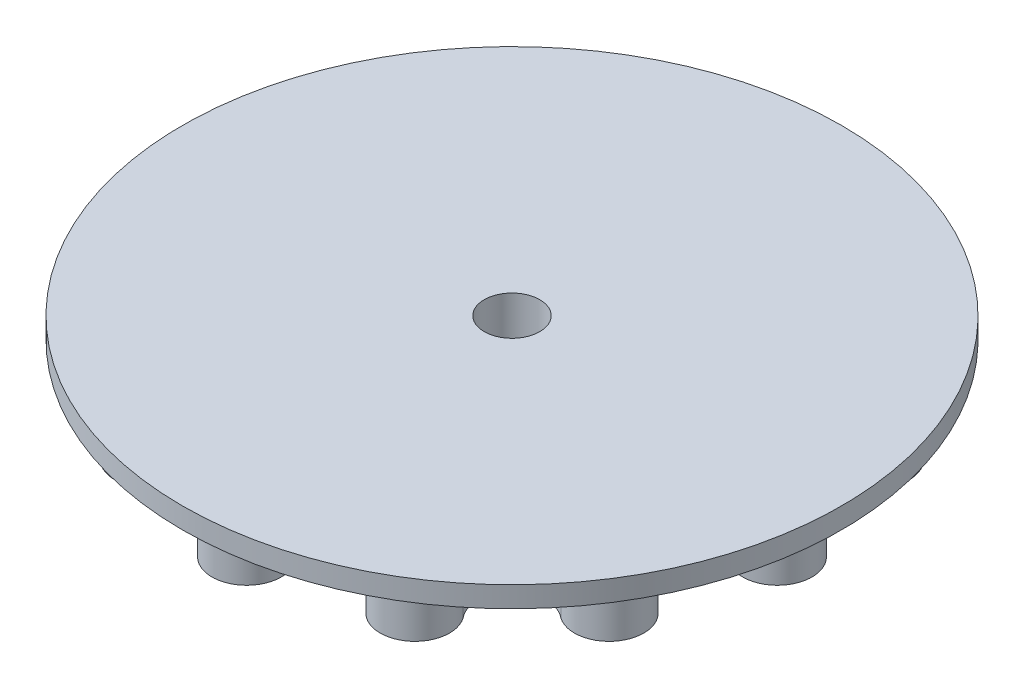
ISO-10303-21;
HEADER;
FILE_DESCRIPTION(('STEP AP214'),'2;1');
FILE_NAME('part.step','',(''),(''),'','','');
FILE_SCHEMA(('AUTOMOTIVE_DESIGN { 1 0 10303 214 1 1 1 1 }'));
ENDSEC;
DATA;
#1=APPLICATION_CONTEXT('core data for automotive mechanical design processes');
#2=APPLICATION_PROTOCOL_DEFINITION('international standard','automotive_design',2000,#1);
#3=PRODUCT_CONTEXT('',#1,'mechanical');
#4=PRODUCT('Part','Part','',(#3));
#5=PRODUCT_RELATED_PRODUCT_CATEGORY('part','',(#4));
#6=PRODUCT_DEFINITION_FORMATION('','',#4);
#7=PRODUCT_DEFINITION_CONTEXT('part definition',#1,'design');
#8=PRODUCT_DEFINITION('design','',#6,#7);
#9=PRODUCT_DEFINITION_SHAPE('','',#8);
#10=(LENGTH_UNIT() NAMED_UNIT(*) SI_UNIT(.MILLI.,.METRE.));
#11=(NAMED_UNIT(*) PLANE_ANGLE_UNIT() SI_UNIT($,.RADIAN.));
#12=(NAMED_UNIT(*) SI_UNIT($,.STERADIAN.) SOLID_ANGLE_UNIT());
#13=UNCERTAINTY_MEASURE_WITH_UNIT(LENGTH_MEASURE(1.E-05),#10,'distance_accuracy_value','');
#14=(GEOMETRIC_REPRESENTATION_CONTEXT(3) GLOBAL_UNCERTAINTY_ASSIGNED_CONTEXT((#13)) GLOBAL_UNIT_ASSIGNED_CONTEXT((#10,
#11,#12)) REPRESENTATION_CONTEXT('',''));
#15=CARTESIAN_POINT('',(0.,0.,0.));
#16=DIRECTION('',(0.,0.,1.));
#17=DIRECTION('',(1.,0.,0.));
#18=AXIS2_PLACEMENT_3D('',#15,#16,#17);
#19=CARTESIAN_POINT('',(-9.89982847517093,8.,-36.946662855557));
#20=DIRECTION('',(0.,-1.,0.));
#21=DIRECTION('',(0.,0.,-1.));
#22=AXIS2_PLACEMENT_3D('',#19,#20,#21);
#23=CYLINDRICAL_SURFACE('',#22,5.00000000000001);
#24=CARTESIAN_POINT('',(-9.89982847517093,0.,-36.946662855557));
#25=DIRECTION('',(0.,1.,0.));
#26=DIRECTION('',(0.,0.,1.));
#27=AXIS2_PLACEMENT_3D('',#24,#25,#26);
#28=CIRCLE('',#27,5.00000000000001);
#29=CARTESIAN_POINT('',(-14.6162880231152,0.,-35.2868407769579));
#30=VERTEX_POINT('',#29);
#31=CARTESIAN_POINT('',(-4.98534365143035,0.,-37.8674445437022));
#32=VERTEX_POINT('',#31);
#33=EDGE_CURVE('E242',#30,#32,#28,.T.);
#34=ORIENTED_EDGE('',*,*,#33,.F.);
#35=DIRECTION('',(0.,-1.,0.));
#36=VECTOR('',#35,1.);
#37=CARTESIAN_POINT('',(-14.6162880231152,8.,-35.2868407769579));
#38=LINE('',#37,#36);
#39=CARTESIAN_POINT('',(-14.6162880231152,8.,-35.2868407769579));
#40=VERTEX_POINT('',#39);
#41=EDGE_CURVE('E11',#40,#30,#38,.T.);
#42=ORIENTED_EDGE('',*,*,#41,.F.);
#43=CARTESIAN_POINT('',(-9.89982847517093,8.,-36.946662855557));
#44=DIRECTION('',(0.,1.,0.));
#45=DIRECTION('',(0.,0.,1.));
#46=AXIS2_PLACEMENT_3D('',#43,#44,#45);
#47=CIRCLE('',#46,5.00000000000001);
#48=CARTESIAN_POINT('',(-4.98534365143035,8.,-37.8674445437022));
#49=VERTEX_POINT('',#48);
#50=EDGE_CURVE('E311',#40,#49,#47,.T.);
#51=ORIENTED_EDGE('',*,*,#50,.T.);
#52=DIRECTION('',(0.,-1.,0.));
#53=VECTOR('',#52,1.);
#54=CARTESIAN_POINT('',(-4.98534365143035,8.,-37.8674445437022));
#55=LINE('',#54,#53);
#56=EDGE_CURVE('E141',#49,#32,#55,.T.);
#57=ORIENTED_EDGE('',*,*,#56,.T.);
#58=EDGE_LOOP('',(#34,#42,#51,#57));
#59=FACE_BOUND('',#58,.T.);
#60=ADVANCED_FACE('F43',(#59),#23,.F.);
#61=CARTESIAN_POINT('',(-19.1249999999998,8.,-33.125471694754));
#62=DIRECTION('',(0.,-1.,0.));
#63=DIRECTION('',(0.,0.,-1.));
#64=AXIS2_PLACEMENT_3D('',#61,#62,#63);
#65=CYLINDRICAL_SURFACE('',#64,5.00000000000093);
#66=CARTESIAN_POINT('',(-19.1249999999998,0.,-33.125471694754));
#67=DIRECTION('',(0.,1.,0.));
#68=DIRECTION('',(0.,0.,1.));
#69=AXIS2_PLACEMENT_3D('',#66,#67,#68);
#70=CIRCLE('',#69,5.00000000000093);
#71=CARTESIAN_POINT('',(-23.2511565205944,0.,-30.3014971255406));
#72=VERTEX_POINT('',#71);
#73=EDGE_CURVE('E245',#30,#72,#70,.T.);
#74=ORIENTED_EDGE('',*,*,#73,.T.);
#75=DIRECTION('',(0.,-1.,0.));
#76=VECTOR('',#75,1.);
#77=CARTESIAN_POINT('',(-23.2511565205944,8.,-30.3014971255406));
#78=LINE('',#77,#76);
#79=CARTESIAN_POINT('',(-23.2511565205944,8.,-30.3014971255406));
#80=VERTEX_POINT('',#79);
#81=EDGE_CURVE('E51',#80,#72,#78,.T.);
#82=ORIENTED_EDGE('',*,*,#81,.F.);
#83=CARTESIAN_POINT('',(-19.1249999999998,8.,-33.125471694754));
#84=DIRECTION('',(0.,1.,0.));
#85=DIRECTION('',(0.,0.,1.));
#86=AXIS2_PLACEMENT_3D('',#83,#84,#85);
#87=CIRCLE('',#86,5.00000000000093);
#88=EDGE_CURVE('E373',#40,#80,#87,.T.);
#89=ORIENTED_EDGE('',*,*,#88,.F.);
#90=ORIENTED_EDGE('',*,*,#41,.T.);
#91=EDGE_LOOP('',(#74,#82,#89,#90));
#92=FACE_BOUND('',#91,.T.);
#93=ADVANCED_FACE('F358',(#92),#65,.T.);
#94=CARTESIAN_POINT('',(-27.046834380385,8.,-27.0468343803843));
#95=DIRECTION('',(0.,-1.,0.));
#96=DIRECTION('',(0.,0.,-1.));
#97=AXIS2_PLACEMENT_3D('',#94,#95,#96);
#98=CYLINDRICAL_SURFACE('',#97,5.00000000000125);
#99=CARTESIAN_POINT('',(-27.046834380385,0.,-27.0468343803843));
#100=DIRECTION('',(0.,1.,0.));
#101=DIRECTION('',(0.,0.,1.));
#102=AXIS2_PLACEMENT_3D('',#99,#100,#101);
#103=CIRCLE('',#102,5.00000000000125);
#104=CARTESIAN_POINT('',(-30.3014971255457,0.,-23.2511565205975));
#105=VERTEX_POINT('',#104);
#106=EDGE_CURVE('E249',#105,#72,#103,.T.);
#107=ORIENTED_EDGE('',*,*,#106,.F.);
#108=DIRECTION('',(0.,-1.,0.));
#109=VECTOR('',#108,1.);
#110=CARTESIAN_POINT('',(-30.3014971255457,8.,-23.2511565205975));
#111=LINE('',#110,#109);
#112=CARTESIAN_POINT('',(-30.3014971255457,8.,-23.2511565205975));
#113=VERTEX_POINT('',#112);
#114=EDGE_CURVE('E348',#113,#105,#111,.T.);
#115=ORIENTED_EDGE('',*,*,#114,.F.);
#116=CARTESIAN_POINT('',(-27.046834380385,8.,-27.0468343803843));
#117=DIRECTION('',(0.,1.,0.));
#118=DIRECTION('',(0.,0.,1.));
#119=AXIS2_PLACEMENT_3D('',#116,#117,#118);
#120=CIRCLE('',#119,5.00000000000125);
#121=EDGE_CURVE('E354',#113,#80,#120,.T.);
#122=ORIENTED_EDGE('',*,*,#121,.T.);
#123=ORIENTED_EDGE('',*,*,#81,.T.);
#124=EDGE_LOOP('',(#107,#115,#122,#123));
#125=FACE_BOUND('',#124,.T.);
#126=ADVANCED_FACE('F352',(#125),#98,.F.);
#127=CARTESIAN_POINT('',(-33.125471694754,8.,-19.1249999999986));
#128=DIRECTION('',(0.,-1.,0.));
#129=DIRECTION('',(0.,0.,-1.));
#130=AXIS2_PLACEMENT_3D('',#127,#128,#129);
#131=CYLINDRICAL_SURFACE('',#130,5.00000000000165);
#132=CARTESIAN_POINT('',(-33.125471694754,0.,-19.1249999999986));
#133=DIRECTION('',(0.,1.,0.));
#134=DIRECTION('',(0.,0.,1.));
#135=AXIS2_PLACEMENT_3D('',#132,#133,#134);
#136=CIRCLE('',#135,5.00000000000165);
#137=CARTESIAN_POINT('',(-35.2868407769857,0.,-14.6162880231265));
#138=VERTEX_POINT('',#137);
#139=EDGE_CURVE('E252',#105,#138,#136,.T.);
#140=ORIENTED_EDGE('',*,*,#139,.T.);
#141=DIRECTION('',(0.,-1.,0.));
#142=VECTOR('',#141,1.);
#143=CARTESIAN_POINT('',(-35.2868407769857,8.,-14.6162880231265));
#144=LINE('',#143,#142);
#145=CARTESIAN_POINT('',(-35.2868407769857,8.,-14.6162880231265));
#146=VERTEX_POINT('',#145);
#147=EDGE_CURVE('E346',#146,#138,#144,.T.);
#148=ORIENTED_EDGE('',*,*,#147,.F.);
#149=CARTESIAN_POINT('',(-33.125471694754,8.,-19.1249999999986));
#150=DIRECTION('',(0.,1.,0.));
#151=DIRECTION('',(0.,0.,1.));
#152=AXIS2_PLACEMENT_3D('',#149,#150,#151);
#153=CIRCLE('',#152,5.00000000000165);
#154=EDGE_CURVE('E369',#113,#146,#153,.T.);
#155=ORIENTED_EDGE('',*,*,#154,.F.);
#156=ORIENTED_EDGE('',*,*,#114,.T.);
#157=EDGE_LOOP('',(#140,#148,#155,#156));
#158=FACE_BOUND('',#157,.T.);
#159=ADVANCED_FACE('F365',(#158),#131,.T.);
#160=CARTESIAN_POINT('',(-36.9466628555557,8.,-9.89982847516984));
#161=DIRECTION('',(0.,-1.,0.));
#162=DIRECTION('',(0.,0.,-1.));
#163=AXIS2_PLACEMENT_3D('',#160,#161,#162);
#164=CYLINDRICAL_SURFACE('',#163,5.00000000000203);
#165=CARTESIAN_POINT('',(-36.9466628555557,0.,-9.89982847516984));
#166=DIRECTION('',(0.,1.,0.));
#167=DIRECTION('',(0.,0.,1.));
#168=AXIS2_PLACEMENT_3D('',#165,#166,#167);
#169=CIRCLE('',#168,5.00000000000203);
#170=CARTESIAN_POINT('',(-37.8674445437367,0.,-4.98534365143392));
#171=VERTEX_POINT('',#170);
#172=EDGE_CURVE('E255',#171,#138,#169,.T.);
#173=ORIENTED_EDGE('',*,*,#172,.F.);
#174=DIRECTION('',(0.,-1.,0.));
#175=VECTOR('',#174,1.);
#176=CARTESIAN_POINT('',(-37.8674445437367,8.,-4.98534365143392));
#177=LINE('',#176,#175);
#178=CARTESIAN_POINT('',(-37.8674445437367,8.,-4.98534365143392));
#179=VERTEX_POINT('',#178);
#180=EDGE_CURVE('E344',#179,#171,#177,.T.);
#181=ORIENTED_EDGE('',*,*,#180,.F.);
#182=CARTESIAN_POINT('',(-36.9466628555557,8.,-9.89982847516984));
#183=DIRECTION('',(0.,1.,0.));
#184=DIRECTION('',(0.,0.,1.));
#185=AXIS2_PLACEMENT_3D('',#182,#183,#184);
#186=CIRCLE('',#185,5.00000000000203);
#187=EDGE_CURVE('E371',#179,#146,#186,.T.);
#188=ORIENTED_EDGE('',*,*,#187,.T.);
#189=ORIENTED_EDGE('',*,*,#147,.T.);
#190=EDGE_LOOP('',(#173,#181,#188,#189));
#191=FACE_BOUND('',#190,.T.);
#192=ADVANCED_FACE('F679',(#191),#164,.F.);
#193=CARTESIAN_POINT('',(-38.2499999999984,8.,1.62835344156606E-12));
#194=DIRECTION('',(0.,-1.,0.));
#195=DIRECTION('',(0.,0.,-1.));
#196=AXIS2_PLACEMENT_3D('',#193,#194,#195);
#197=CYLINDRICAL_SURFACE('',#196,5.00000000000242);
#198=CARTESIAN_POINT('',(-38.2499999999984,0.,1.62835344156606E-12));
#199=DIRECTION('',(0.,1.,0.));
#200=DIRECTION('',(0.,0.,1.));
#201=AXIS2_PLACEMENT_3D('',#198,#199,#200);
#202=CIRCLE('',#201,5.00000000000242);
#203=CARTESIAN_POINT('',(-37.8674445437431,0.,4.98534365143767));
#204=VERTEX_POINT('',#203);
#205=EDGE_CURVE('E258',#171,#204,#202,.T.);
#206=ORIENTED_EDGE('',*,*,#205,.T.);
#207=DIRECTION('',(0.,-1.,0.));
#208=VECTOR('',#207,1.);
#209=CARTESIAN_POINT('',(-37.8674445437431,8.,4.98534365143767));
#210=LINE('',#209,#208);
#211=CARTESIAN_POINT('',(-37.8674445437431,8.,4.98534365143767));
#212=VERTEX_POINT('',#211);
#213=EDGE_CURVE('E342',#212,#204,#210,.T.);
#214=ORIENTED_EDGE('',*,*,#213,.F.);
#215=CARTESIAN_POINT('',(-38.2499999999984,8.,1.62835344156606E-12));
#216=DIRECTION('',(0.,1.,0.));
#217=DIRECTION('',(0.,0.,1.));
#218=AXIS2_PLACEMENT_3D('',#215,#216,#217);
#219=CIRCLE('',#218,5.00000000000242);
#220=EDGE_CURVE('E379',#179,#212,#219,.T.);
#221=ORIENTED_EDGE('',*,*,#220,.F.);
#222=ORIENTED_EDGE('',*,*,#180,.T.);
#223=EDGE_LOOP('',(#206,#214,#221,#222));
#224=FACE_BOUND('',#223,.T.);
#225=ADVANCED_FACE('F669',(#224),#197,.T.);
#226=CARTESIAN_POINT('',(-36.9466628555548,8.,9.89982847517302));
#227=DIRECTION('',(0.,-1.,0.));
#228=DIRECTION('',(0.,0.,-1.));
#229=AXIS2_PLACEMENT_3D('',#226,#227,#228);
#230=CYLINDRICAL_SURFACE('',#229,5.0000000000028);
#231=CARTESIAN_POINT('',(-36.9466628555548,0.,9.89982847517302));
#232=DIRECTION('',(0.,1.,0.));
#233=DIRECTION('',(0.,0.,1.));
#234=AXIS2_PLACEMENT_3D('',#231,#232,#233);
#235=CIRCLE('',#234,5.0000000000028);
#236=CARTESIAN_POINT('',(-35.2868407770035,0.,14.6162880231371));
#237=VERTEX_POINT('',#236);
#238=EDGE_CURVE('E261',#237,#204,#235,.T.);
#239=ORIENTED_EDGE('',*,*,#238,.F.);
#240=DIRECTION('',(0.,-1.,0.));
#241=VECTOR('',#240,1.);
#242=CARTESIAN_POINT('',(-35.2868407770035,8.,14.6162880231371));
#243=LINE('',#242,#241);
#244=CARTESIAN_POINT('',(-35.2868407770035,8.,14.6162880231371));
#245=VERTEX_POINT('',#244);
#246=EDGE_CURVE('E340',#245,#237,#243,.T.);
#247=ORIENTED_EDGE('',*,*,#246,.F.);
#248=CARTESIAN_POINT('',(-36.9466628555548,8.,9.89982847517302));
#249=DIRECTION('',(0.,1.,0.));
#250=DIRECTION('',(0.,0.,1.));
#251=AXIS2_PLACEMENT_3D('',#248,#249,#250);
#252=CIRCLE('',#251,5.0000000000028);
#253=EDGE_CURVE('E382',#245,#212,#252,.T.);
#254=ORIENTED_EDGE('',*,*,#253,.T.);
#255=ORIENTED_EDGE('',*,*,#213,.T.);
#256=EDGE_LOOP('',(#239,#247,#254,#255));
#257=FACE_BOUND('',#256,.T.);
#258=ADVANCED_FACE('F659',(#257),#230,.F.);
#259=CARTESIAN_POINT('',(-33.1254716947523,8.,19.1250000000014));
#260=DIRECTION('',(0.,-1.,0.));
#261=DIRECTION('',(0.,0.,-1.));
#262=AXIS2_PLACEMENT_3D('',#259,#260,#261);
#263=CYLINDRICAL_SURFACE('',#262,5.00000000000309);
#264=CARTESIAN_POINT('',(-33.1254716947523,0.,19.1250000000014));
#265=DIRECTION('',(0.,1.,0.));
#266=DIRECTION('',(0.,0.,1.));
#267=AXIS2_PLACEMENT_3D('',#264,#265,#266);
#268=CIRCLE('',#267,5.00000000000309);
#269=CARTESIAN_POINT('',(-30.3014971255698,0.,23.2511565206198));
#270=VERTEX_POINT('',#269);
#271=EDGE_CURVE('E264',#237,#270,#268,.T.);
#272=ORIENTED_EDGE('',*,*,#271,.T.);
#273=DIRECTION('',(0.,-1.,0.));
#274=VECTOR('',#273,1.);
#275=CARTESIAN_POINT('',(-30.3014971255698,8.,23.2511565206198));
#276=LINE('',#275,#274);
#277=CARTESIAN_POINT('',(-30.3014971255698,8.,23.2511565206198));
#278=VERTEX_POINT('',#277);
#279=EDGE_CURVE('E338',#278,#270,#276,.T.);
#280=ORIENTED_EDGE('',*,*,#279,.F.);
#281=CARTESIAN_POINT('',(-33.1254716947523,8.,19.1250000000014));
#282=DIRECTION('',(0.,1.,0.));
#283=DIRECTION('',(0.,0.,1.));
#284=AXIS2_PLACEMENT_3D('',#281,#282,#283);
#285=CIRCLE('',#284,5.00000000000309);
#286=EDGE_CURVE('E385',#245,#278,#285,.T.);
#287=ORIENTED_EDGE('',*,*,#286,.F.);
#288=ORIENTED_EDGE('',*,*,#246,.T.);
#289=EDGE_LOOP('',(#272,#280,#287,#288));
#290=FACE_BOUND('',#289,.T.);
#291=ADVANCED_FACE('F649',(#290),#263,.T.);
#292=CARTESIAN_POINT('',(-27.0468343803827,8.,27.0468343803866));
#293=DIRECTION('',(0.,-1.,0.));
#294=DIRECTION('',(0.,0.,-1.));
#295=AXIS2_PLACEMENT_3D('',#292,#293,#294);
#296=CYLINDRICAL_SURFACE('',#295,5.00000000000333);
#297=CARTESIAN_POINT('',(-27.0468343803827,0.,27.0468343803866));
#298=DIRECTION('',(0.,1.,0.));
#299=DIRECTION('',(0.,0.,1.));
#300=AXIS2_PLACEMENT_3D('',#297,#298,#299);
#301=CIRCLE('',#300,5.00000000000333);
#302=CARTESIAN_POINT('',(-23.2511565206177,0.,30.3014971255759));
#303=VERTEX_POINT('',#302);
#304=EDGE_CURVE('E267',#303,#270,#301,.T.);
#305=ORIENTED_EDGE('',*,*,#304,.F.);
#306=DIRECTION('',(0.,-1.,0.));
#307=VECTOR('',#306,1.);
#308=CARTESIAN_POINT('',(-23.2511565206177,8.,30.3014971255759));
#309=LINE('',#308,#307);
#310=CARTESIAN_POINT('',(-23.2511565206177,8.,30.3014971255759));
#311=VERTEX_POINT('',#310);
#312=EDGE_CURVE('E336',#311,#303,#309,.T.);
#313=ORIENTED_EDGE('',*,*,#312,.F.);
#314=CARTESIAN_POINT('',(-27.0468343803827,8.,27.0468343803866));
#315=DIRECTION('',(0.,1.,0.));
#316=DIRECTION('',(0.,0.,1.));
#317=AXIS2_PLACEMENT_3D('',#314,#315,#316);
#318=CIRCLE('',#317,5.00000000000333);
#319=EDGE_CURVE('E388',#311,#278,#318,.T.);
#320=ORIENTED_EDGE('',*,*,#319,.T.);
#321=ORIENTED_EDGE('',*,*,#279,.T.);
#322=EDGE_LOOP('',(#305,#313,#320,#321));
#323=FACE_BOUND('',#322,.T.);
#324=ADVANCED_FACE('F639',(#323),#296,.F.);
#325=CARTESIAN_POINT('',(-19.124999999997,8.,33.1254716947556));
#326=DIRECTION('',(0.,-1.,0.));
#327=DIRECTION('',(0.,0.,-1.));
#328=AXIS2_PLACEMENT_3D('',#325,#326,#327);
#329=CYLINDRICAL_SURFACE('',#328,5.00000000000344);
#330=CARTESIAN_POINT('',(-19.124999999997,0.,33.1254716947556));
#331=DIRECTION('',(0.,1.,0.));
#332=DIRECTION('',(0.,0.,1.));
#333=AXIS2_PLACEMENT_3D('',#330,#331,#332);
#334=CIRCLE('',#333,5.00000000000344);
#335=CARTESIAN_POINT('',(-14.6162880231361,0.,35.2868407770147));
#336=VERTEX_POINT('',#335);
#337=EDGE_CURVE('E270',#303,#336,#334,.T.);
#338=ORIENTED_EDGE('',*,*,#337,.T.);
#339=DIRECTION('',(0.,-1.,0.));
#340=VECTOR('',#339,1.);
#341=CARTESIAN_POINT('',(-14.6162880231361,8.,35.2868407770147));
#342=LINE('',#341,#340);
#343=CARTESIAN_POINT('',(-14.6162880231361,8.,35.2868407770147));
#344=VERTEX_POINT('',#343);
#345=EDGE_CURVE('E334',#344,#336,#342,.T.);
#346=ORIENTED_EDGE('',*,*,#345,.F.);
#347=CARTESIAN_POINT('',(-19.124999999997,8.,33.1254716947556));
#348=DIRECTION('',(0.,1.,0.));
#349=DIRECTION('',(0.,0.,1.));
#350=AXIS2_PLACEMENT_3D('',#347,#348,#349);
#351=CIRCLE('',#350,5.00000000000344);
#352=EDGE_CURVE('E391',#311,#344,#351,.T.);
#353=ORIENTED_EDGE('',*,*,#352,.F.);
#354=ORIENTED_EDGE('',*,*,#312,.T.);
#355=EDGE_LOOP('',(#338,#346,#353,#354));
#356=FACE_BOUND('',#355,.T.);
#357=ADVANCED_FACE('F629',(#356),#329,.T.);
#358=CARTESIAN_POINT('',(-9.89982847516822,8.,36.9466628555573));
#359=DIRECTION('',(0.,-1.,0.));
#360=DIRECTION('',(0.,0.,-1.));
#361=AXIS2_PLACEMENT_3D('',#358,#359,#360);
#362=CYLINDRICAL_SURFACE('',#361,5.00000000000346);
#363=CARTESIAN_POINT('',(-9.89982847516822,0.,36.9466628555573));
#364=DIRECTION('',(0.,1.,0.));
#365=DIRECTION('',(0.,0.,1.));
#366=AXIS2_PLACEMENT_3D('',#363,#364,#365);
#367=CIRCLE('',#366,5.00000000000346);
#368=CARTESIAN_POINT('',(-4.98534365143491,0.,37.8674445437601));
#369=VERTEX_POINT('',#368);
#370=EDGE_CURVE('E273',#369,#336,#367,.T.);
#371=ORIENTED_EDGE('',*,*,#370,.F.);
#372=DIRECTION('',(0.,-1.,0.));
#373=VECTOR('',#372,1.);
#374=CARTESIAN_POINT('',(-4.98534365143491,8.,37.8674445437601));
#375=LINE('',#374,#373);
#376=CARTESIAN_POINT('',(-4.98534365143491,8.,37.8674445437601));
#377=VERTEX_POINT('',#376);
#378=EDGE_CURVE('E332',#377,#369,#375,.T.);
#379=ORIENTED_EDGE('',*,*,#378,.F.);
#380=CARTESIAN_POINT('',(-9.89982847516822,8.,36.9466628555573));
#381=DIRECTION('',(0.,1.,0.));
#382=DIRECTION('',(0.,0.,1.));
#383=AXIS2_PLACEMENT_3D('',#380,#381,#382);
#384=CIRCLE('',#383,5.00000000000346);
#385=EDGE_CURVE('E394',#377,#344,#384,.T.);
#386=ORIENTED_EDGE('',*,*,#385,.T.);
#387=ORIENTED_EDGE('',*,*,#345,.T.);
#388=EDGE_LOOP('',(#371,#379,#386,#387));
#389=FACE_BOUND('',#388,.T.);
#390=ADVANCED_FACE('F619',(#389),#362,.F.);
#391=CARTESIAN_POINT('',(3.24733833511864E-12,8.,38.25));
#392=DIRECTION('',(0.,-1.,0.));
#393=DIRECTION('',(0.,0.,-1.));
#394=AXIS2_PLACEMENT_3D('',#391,#392,#393);
#395=CYLINDRICAL_SURFACE('',#394,5.00000000000337);
#396=CARTESIAN_POINT('',(3.24733833511864E-12,0.,38.25));
#397=DIRECTION('',(0.,1.,0.));
#398=DIRECTION('',(0.,0.,1.));
#399=AXIS2_PLACEMENT_3D('',#396,#397,#398);
#400=CIRCLE('',#399,5.00000000000337);
#401=CARTESIAN_POINT('',(4.98534365144116,0.,37.867444543757));
#402=VERTEX_POINT('',#401);
#403=EDGE_CURVE('E276',#369,#402,#400,.T.);
#404=ORIENTED_EDGE('',*,*,#403,.T.);
#405=DIRECTION('',(0.,-1.,0.));
#406=VECTOR('',#405,1.);
#407=CARTESIAN_POINT('',(4.98534365144116,8.,37.867444543757));
#408=LINE('',#407,#406);
#409=CARTESIAN_POINT('',(4.98534365144116,8.,37.867444543757));
#410=VERTEX_POINT('',#409);
#411=EDGE_CURVE('E330',#410,#402,#408,.T.);
#412=ORIENTED_EDGE('',*,*,#411,.F.);
#413=CARTESIAN_POINT('',(3.24733833511864E-12,8.,38.25));
#414=DIRECTION('',(0.,1.,0.));
#415=DIRECTION('',(0.,0.,1.));
#416=AXIS2_PLACEMENT_3D('',#413,#414,#415);
#417=CIRCLE('',#416,5.00000000000337);
#418=EDGE_CURVE('E397',#377,#410,#417,.T.);
#419=ORIENTED_EDGE('',*,*,#418,.F.);
#420=ORIENTED_EDGE('',*,*,#378,.T.);
#421=EDGE_LOOP('',(#404,#412,#419,#420));
#422=FACE_BOUND('',#421,.T.);
#423=ADVANCED_FACE('F609',(#422),#395,.T.);
#424=CARTESIAN_POINT('',(9.89982847517462,8.,36.9466628555564));
#425=DIRECTION('',(0.,-1.,0.));
#426=DIRECTION('',(0.,0.,-1.));
#427=AXIS2_PLACEMENT_3D('',#424,#425,#426);
#428=CYLINDRICAL_SURFACE('',#427,5.00000000000318);
#429=CARTESIAN_POINT('',(9.89982847517462,0.,36.9466628555564));
#430=DIRECTION('',(0.,1.,0.));
#431=DIRECTION('',(0.,0.,1.));
#432=AXIS2_PLACEMENT_3D('',#429,#430,#431);
#433=CIRCLE('',#432,5.00000000000318);
#434=CARTESIAN_POINT('',(14.6162880231395,0.,35.2868407770063));
#435=VERTEX_POINT('',#434);
#436=EDGE_CURVE('E279',#435,#402,#433,.T.);
#437=ORIENTED_EDGE('',*,*,#436,.F.);
#438=DIRECTION('',(0.,-1.,0.));
#439=VECTOR('',#438,1.);
#440=CARTESIAN_POINT('',(14.6162880231395,8.,35.2868407770063));
#441=LINE('',#440,#439);
#442=CARTESIAN_POINT('',(14.6162880231395,8.,35.2868407770063));
#443=VERTEX_POINT('',#442);
#444=EDGE_CURVE('E328',#443,#435,#441,.T.);
#445=ORIENTED_EDGE('',*,*,#444,.F.);
#446=CARTESIAN_POINT('',(9.89982847517462,8.,36.9466628555564));
#447=DIRECTION('',(0.,1.,0.));
#448=DIRECTION('',(0.,0.,1.));
#449=AXIS2_PLACEMENT_3D('',#446,#447,#448);
#450=CIRCLE('',#449,5.00000000000318);
#451=EDGE_CURVE('E400',#443,#410,#450,.T.);
#452=ORIENTED_EDGE('',*,*,#451,.T.);
#453=ORIENTED_EDGE('',*,*,#411,.T.);
#454=EDGE_LOOP('',(#437,#445,#452,#453));
#455=FACE_BOUND('',#454,.T.);
#456=ADVANCED_FACE('F599',(#455),#428,.F.);
#457=CARTESIAN_POINT('',(19.125000000003,8.,33.125471694754));
#458=DIRECTION('',(0.,-1.,0.));
#459=DIRECTION('',(0.,0.,-1.));
#460=AXIS2_PLACEMENT_3D('',#457,#458,#459);
#461=CYLINDRICAL_SURFACE('',#460,5.00000000000289);
#462=CARTESIAN_POINT('',(19.125000000003,0.,33.125471694754));
#463=DIRECTION('',(0.,1.,0.));
#464=DIRECTION('',(0.,0.,1.));
#465=AXIS2_PLACEMENT_3D('',#462,#463,#464);
#466=CIRCLE('',#465,5.00000000000289);
#467=CARTESIAN_POINT('',(23.251156520616,0.,30.3014971255639));
#468=VERTEX_POINT('',#467);
#469=EDGE_CURVE('E282',#435,#468,#466,.T.);
#470=ORIENTED_EDGE('',*,*,#469,.T.);
#471=DIRECTION('',(0.,-1.,0.));
#472=VECTOR('',#471,1.);
#473=CARTESIAN_POINT('',(23.251156520616,8.,30.3014971255639));
#474=LINE('',#473,#472);
#475=CARTESIAN_POINT('',(23.251156520616,8.,30.3014971255639));
#476=VERTEX_POINT('',#475);
#477=EDGE_CURVE('E326',#476,#468,#474,.T.);
#478=ORIENTED_EDGE('',*,*,#477,.F.);
#479=CARTESIAN_POINT('',(19.125000000003,8.,33.125471694754));
#480=DIRECTION('',(0.,1.,0.));
#481=DIRECTION('',(0.,0.,1.));
#482=AXIS2_PLACEMENT_3D('',#479,#480,#481);
#483=CIRCLE('',#482,5.00000000000289);
#484=EDGE_CURVE('E403',#443,#476,#483,.T.);
#485=ORIENTED_EDGE('',*,*,#484,.F.);
#486=ORIENTED_EDGE('',*,*,#444,.T.);
#487=EDGE_LOOP('',(#470,#478,#485,#486));
#488=FACE_BOUND('',#487,.T.);
#489=ADVANCED_FACE('F589',(#488),#461,.T.);
#490=CARTESIAN_POINT('',(27.0468343803882,8.,27.0468343803843));
#491=DIRECTION('',(0.,-1.,0.));
#492=DIRECTION('',(0.,0.,-1.));
#493=AXIS2_PLACEMENT_3D('',#490,#491,#492);
#494=CYLINDRICAL_SURFACE('',#493,5.00000000000251);
#495=CARTESIAN_POINT('',(27.0468343803882,0.,27.0468343803843));
#496=DIRECTION('',(0.,1.,0.));
#497=DIRECTION('',(0.,0.,1.));
#498=AXIS2_PLACEMENT_3D('',#495,#496,#497);
#499=CIRCLE('',#498,5.00000000000251);
#500=CARTESIAN_POINT('',(30.3014971255618,0.,23.2511565206069));
#501=VERTEX_POINT('',#500);
#502=EDGE_CURVE('E285',#501,#468,#499,.T.);
#503=ORIENTED_EDGE('',*,*,#502,.F.);
#504=DIRECTION('',(0.,-1.,0.));
#505=VECTOR('',#504,1.);
#506=CARTESIAN_POINT('',(30.3014971255618,8.,23.2511565206069));
#507=LINE('',#506,#505);
#508=CARTESIAN_POINT('',(30.3014971255618,8.,23.2511565206069));
#509=VERTEX_POINT('',#508);
#510=EDGE_CURVE('E324',#509,#501,#507,.T.);
#511=ORIENTED_EDGE('',*,*,#510,.F.);
#512=CARTESIAN_POINT('',(27.0468343803882,8.,27.0468343803843));
#513=DIRECTION('',(0.,1.,0.));
#514=DIRECTION('',(0.,0.,1.));
#515=AXIS2_PLACEMENT_3D('',#512,#513,#514);
#516=CIRCLE('',#515,5.00000000000251);
#517=EDGE_CURVE('E406',#509,#476,#516,.T.);
#518=ORIENTED_EDGE('',*,*,#517,.T.);
#519=ORIENTED_EDGE('',*,*,#477,.T.);
#520=EDGE_LOOP('',(#503,#511,#518,#519));
#521=FACE_BOUND('',#520,.T.);
#522=ADVANCED_FACE('F579',(#521),#494,.F.);
#523=CARTESIAN_POINT('',(33.1254716947572,8.,19.1249999999986));
#524=DIRECTION('',(0.,-1.,0.));
#525=DIRECTION('',(0.,0.,-1.));
#526=AXIS2_PLACEMENT_3D('',#523,#524,#525);
#527=CYLINDRICAL_SURFACE('',#526,5.0000000000021);
#528=CARTESIAN_POINT('',(33.1254716947572,0.,19.1249999999986));
#529=DIRECTION('',(0.,1.,0.));
#530=DIRECTION('',(0.,0.,1.));
#531=AXIS2_PLACEMENT_3D('',#528,#529,#530);
#532=CIRCLE('',#531,5.0000000000021);
#533=CARTESIAN_POINT('',(35.2868407769897,0.,14.6162880231264));
#534=VERTEX_POINT('',#533);
#535=EDGE_CURVE('E288',#501,#534,#532,.T.);
#536=ORIENTED_EDGE('',*,*,#535,.T.);
#537=DIRECTION('',(0.,-1.,0.));
#538=VECTOR('',#537,1.);
#539=CARTESIAN_POINT('',(35.2868407769897,8.,14.6162880231264));
#540=LINE('',#539,#538);
#541=CARTESIAN_POINT('',(35.2868407769897,8.,14.6162880231264));
#542=VERTEX_POINT('',#541);
#543=EDGE_CURVE('E322',#542,#534,#540,.T.);
#544=ORIENTED_EDGE('',*,*,#543,.F.);
#545=CARTESIAN_POINT('',(33.1254716947572,8.,19.1249999999986));
#546=DIRECTION('',(0.,1.,0.));
#547=DIRECTION('',(0.,0.,1.));
#548=AXIS2_PLACEMENT_3D('',#545,#546,#547);
#549=CIRCLE('',#548,5.0000000000021);
#550=EDGE_CURVE('E409',#509,#542,#549,.T.);
#551=ORIENTED_EDGE('',*,*,#550,.F.);
#552=ORIENTED_EDGE('',*,*,#510,.T.);
#553=EDGE_LOOP('',(#536,#544,#551,#552));
#554=FACE_BOUND('',#553,.T.);
#555=ADVANCED_FACE('F569',(#554),#527,.T.);
#556=CARTESIAN_POINT('',(36.9466628555589,8.,9.89982847516985));
#557=DIRECTION('',(0.,-1.,0.));
#558=DIRECTION('',(0.,0.,-1.));
#559=AXIS2_PLACEMENT_3D('',#556,#557,#558);
#560=CYLINDRICAL_SURFACE('',#559,5.00000000000165);
#561=CARTESIAN_POINT('',(36.9466628555589,0.,9.89982847516985));
#562=DIRECTION('',(0.,1.,0.));
#563=DIRECTION('',(0.,0.,1.));
#564=AXIS2_PLACEMENT_3D('',#561,#562,#563);
#565=CIRCLE('',#564,5.00000000000165);
#566=CARTESIAN_POINT('',(37.8674445437255,0.,4.98534365143159));
#567=VERTEX_POINT('',#566);
#568=EDGE_CURVE('E291',#567,#534,#565,.T.);
#569=ORIENTED_EDGE('',*,*,#568,.F.);
#570=DIRECTION('',(0.,-1.,0.));
#571=VECTOR('',#570,1.);
#572=CARTESIAN_POINT('',(37.8674445437255,8.,4.98534365143159));
#573=LINE('',#572,#571);
#574=CARTESIAN_POINT('',(37.8674445437255,8.,4.98534365143159));
#575=VERTEX_POINT('',#574);
#576=EDGE_CURVE('E320',#575,#567,#573,.T.);
#577=ORIENTED_EDGE('',*,*,#576,.F.);
#578=CARTESIAN_POINT('',(36.9466628555589,8.,9.89982847516985));
#579=DIRECTION('',(0.,1.,0.));
#580=DIRECTION('',(0.,0.,1.));
#581=AXIS2_PLACEMENT_3D('',#578,#579,#580);
#582=CIRCLE('',#581,5.00000000000165);
#583=EDGE_CURVE('E412',#575,#542,#582,.T.);
#584=ORIENTED_EDGE('',*,*,#583,.T.);
#585=ORIENTED_EDGE('',*,*,#543,.T.);
#586=EDGE_LOOP('',(#569,#577,#584,#585));
#587=FACE_BOUND('',#586,.T.);
#588=ADVANCED_FACE('F560',(#587),#560,.F.);
#589=CARTESIAN_POINT('',(38.2500000000016,8.,-1.62366916755932E-12));
#590=DIRECTION('',(0.,-1.,0.));
#591=DIRECTION('',(0.,0.,-1.));
#592=AXIS2_PLACEMENT_3D('',#589,#590,#591);
#593=CYLINDRICAL_SURFACE('',#592,5.00000000000121);
#594=CARTESIAN_POINT('',(38.2500000000016,0.,-1.62366916755932E-12));
#595=DIRECTION('',(0.,1.,0.));
#596=DIRECTION('',(0.,0.,1.));
#597=AXIS2_PLACEMENT_3D('',#594,#595,#596);
#598=CIRCLE('',#597,5.00000000000121);
#599=CARTESIAN_POINT('',(37.8674445437173,0.,-4.98534365143421));
#600=VERTEX_POINT('',#599);
#601=EDGE_CURVE('E294',#567,#600,#598,.T.);
#602=ORIENTED_EDGE('',*,*,#601,.T.);
#603=DIRECTION('',(0.,-1.,0.));
#604=VECTOR('',#603,1.);
#605=CARTESIAN_POINT('',(37.8674445437173,8.,-4.98534365143421));
#606=LINE('',#605,#604);
#607=CARTESIAN_POINT('',(37.8674445437173,8.,-4.98534365143421));
#608=VERTEX_POINT('',#607);
#609=EDGE_CURVE('E318',#608,#600,#606,.T.);
#610=ORIENTED_EDGE('',*,*,#609,.F.);
#611=CARTESIAN_POINT('',(38.2500000000016,8.,-1.62366916755932E-12));
#612=DIRECTION('',(0.,1.,0.));
#613=DIRECTION('',(0.,0.,1.));
#614=AXIS2_PLACEMENT_3D('',#611,#612,#613);
#615=CIRCLE('',#614,5.00000000000121);
#616=EDGE_CURVE('E415',#575,#608,#615,.T.);
#617=ORIENTED_EDGE('',*,*,#616,.F.);
#618=ORIENTED_EDGE('',*,*,#576,.T.);
#619=EDGE_LOOP('',(#602,#610,#617,#618));
#620=FACE_BOUND('',#619,.T.);
#621=ADVANCED_FACE('F424',(#620),#593,.T.);
#622=CARTESIAN_POINT('',(36.9466628555581,8.,-9.89982847517299));
#623=DIRECTION('',(0.,-1.,0.));
#624=DIRECTION('',(0.,0.,-1.));
#625=AXIS2_PLACEMENT_3D('',#622,#623,#624);
#626=CYLINDRICAL_SURFACE('',#625,5.00000000000082);
#627=CARTESIAN_POINT('',(36.9466628555581,0.,-9.89982847517299));
#628=DIRECTION('',(0.,1.,0.));
#629=DIRECTION('',(0.,0.,1.));
#630=AXIS2_PLACEMENT_3D('',#627,#628,#629);
#631=CIRCLE('',#630,5.00000000000082);
#632=CARTESIAN_POINT('',(35.2868407769672,0.,-14.6162880231211));
#633=VERTEX_POINT('',#632);
#634=EDGE_CURVE('E297',#633,#600,#631,.T.);
#635=ORIENTED_EDGE('',*,*,#634,.F.);
#636=DIRECTION('',(0.,-1.,0.));
#637=VECTOR('',#636,1.);
#638=CARTESIAN_POINT('',(35.2868407769672,8.,-14.6162880231211));
#639=LINE('',#638,#637);
#640=CARTESIAN_POINT('',(35.2868407769672,8.,-14.6162880231211));
#641=VERTEX_POINT('',#640);
#642=EDGE_CURVE('E316',#641,#633,#639,.T.);
#643=ORIENTED_EDGE('',*,*,#642,.F.);
#644=CARTESIAN_POINT('',(36.9466628555581,8.,-9.89982847517299));
#645=DIRECTION('',(0.,1.,0.));
#646=DIRECTION('',(0.,0.,1.));
#647=AXIS2_PLACEMENT_3D('',#644,#645,#646);
#648=CIRCLE('',#647,5.00000000000082);
#649=EDGE_CURVE('E234',#641,#608,#648,.T.);
#650=ORIENTED_EDGE('',*,*,#649,.T.);
#651=ORIENTED_EDGE('',*,*,#609,.T.);
#652=EDGE_LOOP('',(#635,#643,#650,#651));
#653=FACE_BOUND('',#652,.T.);
#654=ADVANCED_FACE('F420',(#653),#626,.F.);
#655=CARTESIAN_POINT('',(33.1254716947556,8.,-19.1250000000014));
#656=DIRECTION('',(0.,-1.,0.));
#657=DIRECTION('',(0.,0.,-1.));
#658=AXIS2_PLACEMENT_3D('',#655,#656,#657);
#659=CYLINDRICAL_SURFACE('',#658,5.00000000000046);
#660=CARTESIAN_POINT('',(33.1254716947556,0.,-19.1250000000014));
#661=DIRECTION('',(0.,1.,0.));
#662=DIRECTION('',(0.,0.,1.));
#663=AXIS2_PLACEMENT_3D('',#660,#661,#662);
#664=CIRCLE('',#663,5.00000000000046);
#665=CARTESIAN_POINT('',(30.3014971255307,0.,-23.2511565205876));
#666=VERTEX_POINT('',#665);
#667=EDGE_CURVE('E300',#633,#666,#664,.T.);
#668=ORIENTED_EDGE('',*,*,#667,.T.);
#669=DIRECTION('',(0.,-1.,0.));
#670=VECTOR('',#669,1.);
#671=CARTESIAN_POINT('',(30.3014971255307,8.,-23.2511565205876));
#672=LINE('',#671,#670);
#673=CARTESIAN_POINT('',(30.3014971255307,8.,-23.2511565205876));
#674=VERTEX_POINT('',#673);
#675=EDGE_CURVE('E218',#674,#666,#672,.T.);
#676=ORIENTED_EDGE('',*,*,#675,.F.);
#677=CARTESIAN_POINT('',(33.1254716947556,8.,-19.1250000000014));
#678=DIRECTION('',(0.,1.,0.));
#679=DIRECTION('',(0.,0.,1.));
#680=AXIS2_PLACEMENT_3D('',#677,#678,#679);
#681=CIRCLE('',#680,5.00000000000046);
#682=EDGE_CURVE('E232',#641,#674,#681,.T.);
#683=ORIENTED_EDGE('',*,*,#682,.F.);
#684=ORIENTED_EDGE('',*,*,#642,.T.);
#685=EDGE_LOOP('',(#668,#676,#683,#684));
#686=FACE_BOUND('',#685,.T.);
#687=ADVANCED_FACE('F429',(#686),#659,.T.);
#688=CARTESIAN_POINT('',(27.0468343803859,8.,-27.0468343803866));
#689=DIRECTION('',(0.,-1.,0.));
#690=DIRECTION('',(0.,0.,-1.));
#691=AXIS2_PLACEMENT_3D('',#688,#689,#690);
#692=CYLINDRICAL_SURFACE('',#691,5.00000000000018);
#693=CARTESIAN_POINT('',(27.0468343803859,0.,-27.0468343803866));
#694=DIRECTION('',(0.,1.,0.));
#695=DIRECTION('',(0.,0.,1.));
#696=AXIS2_PLACEMENT_3D('',#693,#694,#695);
#697=CIRCLE('',#696,5.00000000000018);
#698=CARTESIAN_POINT('',(23.2511565205858,0.,-30.30149712553));
#699=VERTEX_POINT('',#698);
#700=EDGE_CURVE('E214',#699,#666,#697,.T.);
#701=ORIENTED_EDGE('',*,*,#700,.F.);
#702=DIRECTION('',(0.,-1.,0.));
#703=VECTOR('',#702,1.);
#704=CARTESIAN_POINT('',(23.2511565205858,8.,-30.30149712553));
#705=LINE('',#704,#703);
#706=CARTESIAN_POINT('',(23.2511565205858,8.,-30.30149712553));
#707=VERTEX_POINT('',#706);
#708=EDGE_CURVE('E207',#707,#699,#705,.T.);
#709=ORIENTED_EDGE('',*,*,#708,.F.);
#710=CARTESIAN_POINT('',(27.0468343803859,8.,-27.0468343803866));
#711=DIRECTION('',(0.,1.,0.));
#712=DIRECTION('',(0.,0.,1.));
#713=AXIS2_PLACEMENT_3D('',#710,#711,#712);
#714=CIRCLE('',#713,5.00000000000018);
#715=EDGE_CURVE('E211',#707,#674,#714,.T.);
#716=ORIENTED_EDGE('',*,*,#715,.T.);
#717=ORIENTED_EDGE('',*,*,#675,.T.);
#718=EDGE_LOOP('',(#701,#709,#716,#717));
#719=FACE_BOUND('',#718,.T.);
#720=ADVANCED_FACE('F209',(#719),#692,.F.);
#721=CARTESIAN_POINT('',(19.125,8.,-33.1254716947548));
#722=DIRECTION('',(0.,-1.,0.));
#723=DIRECTION('',(0.,0.,-1.));
#724=AXIS2_PLACEMENT_3D('',#721,#722,#723);
#725=CYLINDRICAL_SURFACE('',#724,5.00000000000001);
#726=CARTESIAN_POINT('',(19.125,0.,-33.1254716947548));
#727=DIRECTION('',(0.,1.,0.));
#728=DIRECTION('',(0.,0.,1.));
#729=AXIS2_PLACEMENT_3D('',#726,#727,#728);
#730=CIRCLE('',#729,5.00000000000001);
#731=CARTESIAN_POINT('',(14.6162880231149,0.,-35.2868407769554));
#732=VERTEX_POINT('',#731);
#733=EDGE_CURVE('E304',#699,#732,#730,.T.);
#734=ORIENTED_EDGE('',*,*,#733,.T.);
#735=DIRECTION('',(0.,-1.,0.));
#736=VECTOR('',#735,1.);
#737=CARTESIAN_POINT('',(14.6162880231149,8.,-35.2868407769554));
#738=LINE('',#737,#736);
#739=CARTESIAN_POINT('',(14.6162880231149,8.,-35.2868407769554));
#740=VERTEX_POINT('',#739);
#741=EDGE_CURVE('E219',#740,#732,#738,.T.);
#742=ORIENTED_EDGE('',*,*,#741,.F.);
#743=CARTESIAN_POINT('',(19.125,8.,-33.1254716947548));
#744=DIRECTION('',(0.,1.,0.));
#745=DIRECTION('',(0.,0.,1.));
#746=AXIS2_PLACEMENT_3D('',#743,#744,#745);
#747=CIRCLE('',#746,5.00000000000001);
#748=EDGE_CURVE('E222',#707,#740,#747,.T.);
#749=ORIENTED_EDGE('',*,*,#748,.F.);
#750=ORIENTED_EDGE('',*,*,#708,.T.);
#751=EDGE_LOOP('',(#734,#742,#749,#750));
#752=FACE_BOUND('',#751,.T.);
#753=ADVANCED_FACE('F223',(#752),#725,.T.);
#754=CARTESIAN_POINT('',(9.89982847517144,8.,-36.9466628555569));
#755=DIRECTION('',(0.,-1.,0.));
#756=DIRECTION('',(0.,0.,-1.));
#757=AXIS2_PLACEMENT_3D('',#754,#755,#756);
#758=CYLINDRICAL_SURFACE('',#757,5.);
#759=CARTESIAN_POINT('',(9.89982847517144,0.,-36.9466628555569));
#760=DIRECTION('',(0.,1.,0.));
#761=DIRECTION('',(0.,0.,1.));
#762=AXIS2_PLACEMENT_3D('',#759,#760,#761);
#763=CIRCLE('',#762,5.);
#764=CARTESIAN_POINT('',(4.98534365142997,0.,-37.8674445436973));
#765=VERTEX_POINT('',#764);
#766=EDGE_CURVE('E306',#765,#732,#763,.T.);
#767=ORIENTED_EDGE('',*,*,#766,.F.);
#768=DIRECTION('',(0.,-1.,0.));
#769=VECTOR('',#768,1.);
#770=CARTESIAN_POINT('',(4.98534365142997,8.,-37.8674445436973));
#771=LINE('',#770,#769);
#772=CARTESIAN_POINT('',(4.98534365142997,8.,-37.8674445436973));
#773=VERTEX_POINT('',#772);
#774=EDGE_CURVE('E59',#773,#765,#771,.T.);
#775=ORIENTED_EDGE('',*,*,#774,.F.);
#776=CARTESIAN_POINT('',(9.89982847517144,8.,-36.9466628555569));
#777=DIRECTION('',(0.,1.,0.));
#778=DIRECTION('',(0.,0.,1.));
#779=AXIS2_PLACEMENT_3D('',#776,#777,#778);
#780=CIRCLE('',#779,5.);
#781=EDGE_CURVE('E226',#773,#740,#780,.T.);
#782=ORIENTED_EDGE('',*,*,#781,.T.);
#783=ORIENTED_EDGE('',*,*,#741,.T.);
#784=EDGE_LOOP('',(#767,#775,#782,#783));
#785=FACE_BOUND('',#784,.T.);
#786=ADVANCED_FACE('F442',(#785),#758,.F.);
#787=CARTESIAN_POINT('',(0.,8.,-38.25));
#788=DIRECTION('',(0.,-1.,0.));
#789=DIRECTION('',(0.,0.,-1.));
#790=AXIS2_PLACEMENT_3D('',#787,#788,#789);
#791=CYLINDRICAL_SURFACE('',#790,5.00000000000001);
#792=CARTESIAN_POINT('',(0.,0.,-38.25));
#793=DIRECTION('',(0.,1.,0.));
#794=DIRECTION('',(0.,0.,1.));
#795=AXIS2_PLACEMENT_3D('',#792,#793,#794);
#796=CIRCLE('',#795,5.00000000000001);
#797=EDGE_CURVE('E309',#765,#32,#796,.T.);
#798=ORIENTED_EDGE('',*,*,#797,.T.);
#799=ORIENTED_EDGE('',*,*,#56,.F.);
#800=CARTESIAN_POINT('',(0.,8.,-38.25));
#801=DIRECTION('',(0.,1.,0.));
#802=DIRECTION('',(0.,0.,1.));
#803=AXIS2_PLACEMENT_3D('',#800,#801,#802);
#804=CIRCLE('',#803,5.00000000000001);
#805=EDGE_CURVE('E239',#773,#49,#804,.T.);
#806=ORIENTED_EDGE('',*,*,#805,.F.);
#807=ORIENTED_EDGE('',*,*,#774,.T.);
#808=EDGE_LOOP('',(#798,#799,#806,#807));
#809=FACE_BOUND('',#808,.T.);
#810=ADVANCED_FACE('F443',(#809),#791,.T.);
#811=CARTESIAN_POINT('',(0.,0.,0.));
#812=DIRECTION('',(0.,1.,0.));
#813=DIRECTION('',(0.,0.,1.));
#814=AXIS2_PLACEMENT_3D('',#811,#812,#813);
#815=PLANE('',#814);
#816=CARTESIAN_POINT('',(0.,0.,0.));
#817=DIRECTION('',(0.,1.,0.));
#818=DIRECTION('',(0.,0.,1.));
#819=AXIS2_PLACEMENT_3D('',#816,#817,#818);
#820=CIRCLE('',#819,4.);
#821=CARTESIAN_POINT('',(0.,0.,4.));
#822=VERTEX_POINT('',#821);
#823=EDGE_CURVE('E877',#822,#822,#820,.T.);
#824=ORIENTED_EDGE('',*,*,#823,.T.);
#825=EDGE_LOOP('',(#824));
#826=FACE_BOUND('',#825,.T.);
#827=ORIENTED_EDGE('',*,*,#33,.T.);
#828=ORIENTED_EDGE('',*,*,#797,.F.);
#829=ORIENTED_EDGE('',*,*,#766,.T.);
#830=ORIENTED_EDGE('',*,*,#733,.F.);
#831=ORIENTED_EDGE('',*,*,#700,.T.);
#832=ORIENTED_EDGE('',*,*,#667,.F.);
#833=ORIENTED_EDGE('',*,*,#634,.T.);
#834=ORIENTED_EDGE('',*,*,#601,.F.);
#835=ORIENTED_EDGE('',*,*,#568,.T.);
#836=ORIENTED_EDGE('',*,*,#535,.F.);
#837=ORIENTED_EDGE('',*,*,#502,.T.);
#838=ORIENTED_EDGE('',*,*,#469,.F.);
#839=ORIENTED_EDGE('',*,*,#436,.T.);
#840=ORIENTED_EDGE('',*,*,#403,.F.);
#841=ORIENTED_EDGE('',*,*,#370,.T.);
#842=ORIENTED_EDGE('',*,*,#337,.F.);
#843=ORIENTED_EDGE('',*,*,#304,.T.);
#844=ORIENTED_EDGE('',*,*,#271,.F.);
#845=ORIENTED_EDGE('',*,*,#238,.T.);
#846=ORIENTED_EDGE('',*,*,#205,.F.);
#847=ORIENTED_EDGE('',*,*,#172,.T.);
#848=ORIENTED_EDGE('',*,*,#139,.F.);
#849=ORIENTED_EDGE('',*,*,#106,.T.);
#850=ORIENTED_EDGE('',*,*,#73,.F.);
#851=EDGE_LOOP('',(#827,#828,#829,#830,#831,#832,#833,#834,#835,#836,#837,#838,#839,#840,#841,
#842,#843,#844,#845,#846,#847,#848,#849,#850));
#852=FACE_BOUND('',#851,.T.);
#853=ADVANCED_FACE('F361',(#826,#852),#815,.F.);
#854=CARTESIAN_POINT('',(0.,8.,0.));
#855=DIRECTION('',(0.,1.,0.));
#856=DIRECTION('',(0.,0.,1.));
#857=AXIS2_PLACEMENT_3D('',#854,#855,#856);
#858=PLANE('',#857);
#859=CARTESIAN_POINT('',(0.,8.,0.));
#860=DIRECTION('',(0.,1.,0.));
#861=DIRECTION('',(0.,0.,1.));
#862=AXIS2_PLACEMENT_3D('',#859,#860,#861);
#863=CIRCLE('',#862,47.5);
#864=CARTESIAN_POINT('',(0.,8.,47.5));
#865=VERTEX_POINT('',#864);
#866=EDGE_CURVE('E878',#865,#865,#863,.T.);
#867=ORIENTED_EDGE('',*,*,#866,.F.);
#868=EDGE_LOOP('',(#867));
#869=FACE_BOUND('',#868,.T.);
#870=ORIENTED_EDGE('',*,*,#50,.F.);
#871=ORIENTED_EDGE('',*,*,#88,.T.);
#872=ORIENTED_EDGE('',*,*,#121,.F.);
#873=ORIENTED_EDGE('',*,*,#154,.T.);
#874=ORIENTED_EDGE('',*,*,#187,.F.);
#875=ORIENTED_EDGE('',*,*,#220,.T.);
#876=ORIENTED_EDGE('',*,*,#253,.F.);
#877=ORIENTED_EDGE('',*,*,#286,.T.);
#878=ORIENTED_EDGE('',*,*,#319,.F.);
#879=ORIENTED_EDGE('',*,*,#352,.T.);
#880=ORIENTED_EDGE('',*,*,#385,.F.);
#881=ORIENTED_EDGE('',*,*,#418,.T.);
#882=ORIENTED_EDGE('',*,*,#451,.F.);
#883=ORIENTED_EDGE('',*,*,#484,.T.);
#884=ORIENTED_EDGE('',*,*,#517,.F.);
#885=ORIENTED_EDGE('',*,*,#550,.T.);
#886=ORIENTED_EDGE('',*,*,#583,.F.);
#887=ORIENTED_EDGE('',*,*,#616,.T.);
#888=ORIENTED_EDGE('',*,*,#649,.F.);
#889=ORIENTED_EDGE('',*,*,#682,.T.);
#890=ORIENTED_EDGE('',*,*,#715,.F.);
#891=ORIENTED_EDGE('',*,*,#748,.T.);
#892=ORIENTED_EDGE('',*,*,#781,.F.);
#893=ORIENTED_EDGE('',*,*,#805,.T.);
#894=EDGE_LOOP('',(#870,#871,#872,#873,#874,#875,#876,#877,#878,#879,#880,#881,#882,#883,#884,
#885,#886,#887,#888,#889,#890,#891,#892,#893));
#895=FACE_BOUND('',#894,.T.);
#896=ADVANCED_FACE('F229',(#869,#895),#858,.F.);
#897=CARTESIAN_POINT('',(0.,11.,0.));
#898=DIRECTION('',(0.,-1.,0.));
#899=DIRECTION('',(0.,0.,-1.));
#900=AXIS2_PLACEMENT_3D('',#897,#898,#899);
#901=CYLINDRICAL_SURFACE('',#900,47.5);
#902=CARTESIAN_POINT('',(0.,11.,0.));
#903=DIRECTION('',(0.,1.,0.));
#904=DIRECTION('',(0.,0.,1.));
#905=AXIS2_PLACEMENT_3D('',#902,#903,#904);
#906=CIRCLE('',#905,47.5);
#907=CARTESIAN_POINT('',(0.,11.,47.5));
#908=VERTEX_POINT('',#907);
#909=EDGE_CURVE('E246',#908,#908,#906,.T.);
#910=ORIENTED_EDGE('',*,*,#909,.F.);
#911=EDGE_LOOP('',(#910));
#912=FACE_BOUND('',#911,.T.);
#913=ORIENTED_EDGE('',*,*,#866,.T.);
#914=EDGE_LOOP('',(#913));
#915=FACE_BOUND('',#914,.T.);
#916=ADVANCED_FACE('F480',(#912,#915),#901,.T.);
#917=CARTESIAN_POINT('',(0.,11.,0.));
#918=DIRECTION('',(0.,1.,0.));
#919=DIRECTION('',(0.,0.,1.));
#920=AXIS2_PLACEMENT_3D('',#917,#918,#919);
#921=PLANE('',#920);
#922=CARTESIAN_POINT('',(0.,11.,0.));
#923=DIRECTION('',(0.,1.,0.));
#924=DIRECTION('',(0.,0.,1.));
#925=AXIS2_PLACEMENT_3D('',#922,#923,#924);
#926=CIRCLE('',#925,4.);
#927=CARTESIAN_POINT('',(0.,11.,4.));
#928=VERTEX_POINT('',#927);
#929=EDGE_CURVE('E874',#928,#928,#926,.T.);
#930=ORIENTED_EDGE('',*,*,#929,.F.);
#931=EDGE_LOOP('',(#930));
#932=FACE_BOUND('',#931,.T.);
#933=ORIENTED_EDGE('',*,*,#909,.T.);
#934=EDGE_LOOP('',(#933));
#935=FACE_BOUND('',#934,.T.);
#936=ADVANCED_FACE('F492',(#932,#935),#921,.T.);
#937=CARTESIAN_POINT('',(0.,-19.,0.));
#938=DIRECTION('',(0.,1.,0.));
#939=DIRECTION('',(0.,0.,1.));
#940=AXIS2_PLACEMENT_3D('',#937,#938,#939);
#941=CYLINDRICAL_SURFACE('',#940,4.);
#942=ORIENTED_EDGE('',*,*,#929,.T.);
#943=EDGE_LOOP('',(#942));
#944=FACE_BOUND('',#943,.T.);
#945=ORIENTED_EDGE('',*,*,#823,.F.);
#946=EDGE_LOOP('',(#945));
#947=FACE_BOUND('',#946,.T.);
#948=ADVANCED_FACE('F508',(#944,#947),#941,.F.);
#949=CLOSED_SHELL('',(#60,#93,#126,#159,#192,#225,#258,#291,#324,#357,#390,#423,#456,#489,#522,
#555,#588,#621,#654,#687,#720,#753,#786,#810,#853,#896,#916,#936,#948));
#950=MANIFOLD_SOLID_BREP('B2',#949);
#951=ADVANCED_BREP_SHAPE_REPRESENTATION('',(#18,#950),#14);
#952=SHAPE_DEFINITION_REPRESENTATION(#9,#951);
ENDSEC;
END-ISO-10303-21;
